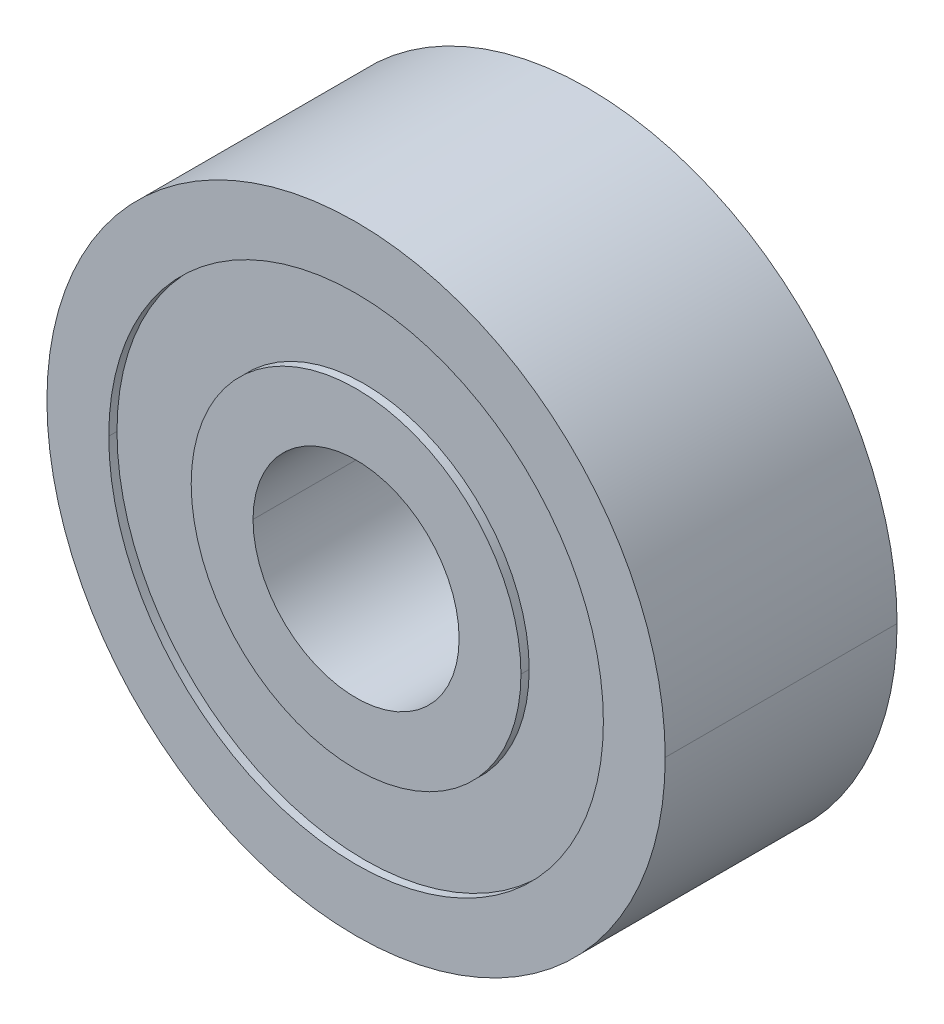
ISO-10303-21;
HEADER;
FILE_DESCRIPTION(('STEP AP214'),'2;1');
FILE_NAME('part.step','',(''),(''),'','','');
FILE_SCHEMA(('AUTOMOTIVE_DESIGN { 1 0 10303 214 1 1 1 1 }'));
ENDSEC;
DATA;
#1=APPLICATION_CONTEXT('core data for automotive mechanical design processes');
#2=APPLICATION_PROTOCOL_DEFINITION('international standard','automotive_design',2000,#1);
#3=PRODUCT_CONTEXT('',#1,'mechanical');
#4=PRODUCT('Part','Part','',(#3));
#5=PRODUCT_RELATED_PRODUCT_CATEGORY('part','',(#4));
#6=PRODUCT_DEFINITION_FORMATION('','',#4);
#7=PRODUCT_DEFINITION_CONTEXT('part definition',#1,'design');
#8=PRODUCT_DEFINITION('design','',#6,#7);
#9=PRODUCT_DEFINITION_SHAPE('','',#8);
#10=(LENGTH_UNIT() NAMED_UNIT(*) SI_UNIT(.MILLI.,.METRE.));
#11=(NAMED_UNIT(*) PLANE_ANGLE_UNIT() SI_UNIT($,.RADIAN.));
#12=(NAMED_UNIT(*) SI_UNIT($,.STERADIAN.) SOLID_ANGLE_UNIT());
#13=UNCERTAINTY_MEASURE_WITH_UNIT(LENGTH_MEASURE(1.E-05),#10,'distance_accuracy_value','');
#14=(GEOMETRIC_REPRESENTATION_CONTEXT(3) GLOBAL_UNCERTAINTY_ASSIGNED_CONTEXT((#13)) GLOBAL_UNIT_ASSIGNED_CONTEXT((#10,
#11,#12)) REPRESENTATION_CONTEXT('',''));
#15=CARTESIAN_POINT('',(0.,0.,0.));
#16=DIRECTION('',(0.,0.,1.));
#17=DIRECTION('',(1.,0.,0.));
#18=AXIS2_PLACEMENT_3D('',#15,#16,#17);
#19=CARTESIAN_POINT('',(0.,0.,-3.571875));
#20=DIRECTION('',(0.,0.,-1.));
#21=DIRECTION('',(-1.,0.,0.));
#22=AXIS2_PLACEMENT_3D('',#19,#20,#21);
#23=CYLINDRICAL_SURFACE('',#22,5.08);
#24=DIRECTION('',(0.,0.,-1.));
#25=VECTOR('',#24,1.);
#26=CARTESIAN_POINT('',(5.08,0.,-3.571875));
#27=LINE('',#26,#25);
#28=CARTESIAN_POINT('',(5.08,0.,-3.317875));
#29=VERTEX_POINT('',#28);
#30=CARTESIAN_POINT('',(5.08,0.,-3.571875));
#31=VERTEX_POINT('',#30);
#32=EDGE_CURVE('E232',#29,#31,#27,.T.);
#33=ORIENTED_EDGE('',*,*,#32,.F.);
#34=CARTESIAN_POINT('',(0.,0.,-3.317875));
#35=DIRECTION('',(0.,0.,-1.));
#36=DIRECTION('',(-1.,0.,0.));
#37=AXIS2_PLACEMENT_3D('',#34,#35,#36);
#38=CIRCLE('',#37,5.08);
#39=CARTESIAN_POINT('',(-5.08,0.,-3.317875));
#40=VERTEX_POINT('',#39);
#41=EDGE_CURVE('E11',#29,#40,#38,.T.);
#42=ORIENTED_EDGE('',*,*,#41,.T.);
#43=DIRECTION('',(0.,0.,-1.));
#44=VECTOR('',#43,1.);
#45=CARTESIAN_POINT('',(-5.08,0.,-3.571875));
#46=LINE('',#45,#44);
#47=CARTESIAN_POINT('',(-5.08,0.,-3.571875));
#48=VERTEX_POINT('',#47);
#49=EDGE_CURVE('E154',#40,#48,#46,.T.);
#50=ORIENTED_EDGE('',*,*,#49,.T.);
#51=CARTESIAN_POINT('',(0.,0.,-3.571875));
#52=DIRECTION('',(0.,0.,-1.));
#53=DIRECTION('',(-1.,0.,0.));
#54=AXIS2_PLACEMENT_3D('',#51,#52,#53);
#55=CIRCLE('',#54,5.08);
#56=EDGE_CURVE('E239',#31,#48,#55,.T.);
#57=ORIENTED_EDGE('',*,*,#56,.F.);
#58=EDGE_LOOP('',(#33,#42,#50,#57));
#59=FACE_BOUND('',#58,.T.);
#60=ADVANCED_FACE('F16',(#59),#23,.T.);
#61=CARTESIAN_POINT('',(7.62,0.,-3.317875));
#62=DIRECTION('',(0.,0.,1.));
#63=DIRECTION('',(1.,0.,0.));
#64=AXIS2_PLACEMENT_3D('',#61,#62,#63);
#65=PLANE('',#64);
#66=CARTESIAN_POINT('',(0.,0.,-3.317875));
#67=DIRECTION('',(0.,0.,-1.));
#68=DIRECTION('',(-1.,0.,0.));
#69=AXIS2_PLACEMENT_3D('',#66,#67,#68);
#70=CIRCLE('',#69,5.08);
#71=EDGE_CURVE('E236',#40,#29,#70,.T.);
#72=ORIENTED_EDGE('',*,*,#71,.F.);
#73=ORIENTED_EDGE('',*,*,#41,.F.);
#74=EDGE_LOOP('',(#72,#73));
#75=FACE_BOUND('',#74,.T.);
#76=CARTESIAN_POINT('',(0.,0.,-3.317875));
#77=DIRECTION('',(0.,0.,-1.));
#78=DIRECTION('',(-1.,0.,0.));
#79=AXIS2_PLACEMENT_3D('',#76,#77,#78);
#80=CIRCLE('',#79,7.62);
#81=CARTESIAN_POINT('',(-7.62,0.,-3.317875));
#82=VERTEX_POINT('',#81);
#83=CARTESIAN_POINT('',(7.62,0.,-3.317875));
#84=VERTEX_POINT('',#83);
#85=EDGE_CURVE('E27',#82,#84,#80,.T.);
#86=ORIENTED_EDGE('',*,*,#85,.T.);
#87=CARTESIAN_POINT('',(0.,0.,-3.317875));
#88=DIRECTION('',(0.,0.,-1.));
#89=DIRECTION('',(-1.,0.,0.));
#90=AXIS2_PLACEMENT_3D('',#87,#88,#89);
#91=CIRCLE('',#90,7.62);
#92=EDGE_CURVE('E146',#84,#82,#91,.T.);
#93=ORIENTED_EDGE('',*,*,#92,.T.);
#94=EDGE_LOOP('',(#86,#93));
#95=FACE_BOUND('',#94,.T.);
#96=ADVANCED_FACE('F152',(#75,#95),#65,.F.);
#97=CARTESIAN_POINT('',(0.,0.,-3.571875));
#98=DIRECTION('',(0.,0.,-1.));
#99=DIRECTION('',(-1.,0.,0.));
#100=AXIS2_PLACEMENT_3D('',#97,#98,#99);
#101=CYLINDRICAL_SURFACE('',#100,7.62);
#102=DIRECTION('',(0.,0.,-1.));
#103=VECTOR('',#102,1.);
#104=CARTESIAN_POINT('',(7.62,0.,-3.571875));
#105=LINE('',#104,#103);
#106=CARTESIAN_POINT('',(7.62,0.,-3.571875));
#107=VERTEX_POINT('',#106);
#108=EDGE_CURVE('E137',#84,#107,#105,.T.);
#109=ORIENTED_EDGE('',*,*,#108,.F.);
#110=ORIENTED_EDGE('',*,*,#85,.F.);
#111=DIRECTION('',(0.,0.,-1.));
#112=VECTOR('',#111,1.);
#113=CARTESIAN_POINT('',(-7.62,0.,-3.571875));
#114=LINE('',#113,#112);
#115=CARTESIAN_POINT('',(-7.62,0.,-3.571875));
#116=VERTEX_POINT('',#115);
#117=EDGE_CURVE('E134',#82,#116,#114,.T.);
#118=ORIENTED_EDGE('',*,*,#117,.T.);
#119=CARTESIAN_POINT('',(0.,0.,-3.571875));
#120=DIRECTION('',(0.,0.,-1.));
#121=DIRECTION('',(-1.,0.,0.));
#122=AXIS2_PLACEMENT_3D('',#119,#120,#121);
#123=CIRCLE('',#122,7.62);
#124=EDGE_CURVE('E142',#116,#107,#123,.T.);
#125=ORIENTED_EDGE('',*,*,#124,.T.);
#126=EDGE_LOOP('',(#109,#110,#118,#125));
#127=FACE_BOUND('',#126,.T.);
#128=ADVANCED_FACE('F133',(#127),#101,.F.);
#129=CARTESIAN_POINT('',(9.525,0.,-3.571875));
#130=DIRECTION('',(0.,0.,1.));
#131=DIRECTION('',(1.,0.,0.));
#132=AXIS2_PLACEMENT_3D('',#129,#130,#131);
#133=PLANE('',#132);
#134=ORIENTED_EDGE('',*,*,#124,.F.);
#135=CARTESIAN_POINT('',(0.,0.,-3.571875));
#136=DIRECTION('',(0.,0.,-1.));
#137=DIRECTION('',(-1.,0.,0.));
#138=AXIS2_PLACEMENT_3D('',#135,#136,#137);
#139=CIRCLE('',#138,7.62);
#140=EDGE_CURVE('E148',#107,#116,#139,.T.);
#141=ORIENTED_EDGE('',*,*,#140,.F.);
#142=EDGE_LOOP('',(#134,#141));
#143=FACE_BOUND('',#142,.T.);
#144=CARTESIAN_POINT('',(0.,0.,-3.571875));
#145=DIRECTION('',(0.,0.,-1.));
#146=DIRECTION('',(-1.,0.,0.));
#147=AXIS2_PLACEMENT_3D('',#144,#145,#146);
#148=CIRCLE('',#147,9.525);
#149=CARTESIAN_POINT('',(-9.525,0.,-3.571875));
#150=VERTEX_POINT('',#149);
#151=CARTESIAN_POINT('',(9.525,0.,-3.571875));
#152=VERTEX_POINT('',#151);
#153=EDGE_CURVE('E173',#150,#152,#148,.T.);
#154=ORIENTED_EDGE('',*,*,#153,.T.);
#155=CARTESIAN_POINT('',(0.,0.,-3.571875));
#156=DIRECTION('',(0.,0.,-1.));
#157=DIRECTION('',(-1.,0.,0.));
#158=AXIS2_PLACEMENT_3D('',#155,#156,#157);
#159=CIRCLE('',#158,9.525);
#160=EDGE_CURVE('E231',#152,#150,#159,.T.);
#161=ORIENTED_EDGE('',*,*,#160,.T.);
#162=EDGE_LOOP('',(#154,#161));
#163=FACE_BOUND('',#162,.T.);
#164=ADVANCED_FACE('F336',(#143,#163),#133,.F.);
#165=CARTESIAN_POINT('',(0.,0.,-3.571875));
#166=DIRECTION('',(0.,0.,-1.));
#167=DIRECTION('',(-1.,0.,0.));
#168=AXIS2_PLACEMENT_3D('',#165,#166,#167);
#169=CYLINDRICAL_SURFACE('',#168,9.525);
#170=DIRECTION('',(0.,0.,-1.));
#171=VECTOR('',#170,1.);
#172=CARTESIAN_POINT('',(9.525,0.,-3.571875));
#173=LINE('',#172,#171);
#174=CARTESIAN_POINT('',(9.525,0.,3.571875));
#175=VERTEX_POINT('',#174);
#176=EDGE_CURVE('E169',#175,#152,#173,.T.);
#177=ORIENTED_EDGE('',*,*,#176,.F.);
#178=CARTESIAN_POINT('',(0.,0.,3.571875));
#179=DIRECTION('',(0.,0.,-1.));
#180=DIRECTION('',(-1.,0.,0.));
#181=AXIS2_PLACEMENT_3D('',#178,#179,#180);
#182=CIRCLE('',#181,9.525);
#183=CARTESIAN_POINT('',(-9.525,0.,3.571875));
#184=VERTEX_POINT('',#183);
#185=EDGE_CURVE('E190',#175,#184,#182,.T.);
#186=ORIENTED_EDGE('',*,*,#185,.T.);
#187=DIRECTION('',(0.,0.,-1.));
#188=VECTOR('',#187,1.);
#189=CARTESIAN_POINT('',(-9.525,0.,-3.571875));
#190=LINE('',#189,#188);
#191=EDGE_CURVE('E210',#184,#150,#190,.T.);
#192=ORIENTED_EDGE('',*,*,#191,.T.);
#193=ORIENTED_EDGE('',*,*,#160,.F.);
#194=EDGE_LOOP('',(#177,#186,#192,#193));
#195=FACE_BOUND('',#194,.T.);
#196=ADVANCED_FACE('F18',(#195),#169,.T.);
#197=CARTESIAN_POINT('',(7.62,0.,3.571875));
#198=DIRECTION('',(0.,0.,-1.));
#199=DIRECTION('',(0.,-1.,0.));
#200=AXIS2_PLACEMENT_3D('',#197,#198,#199);
#201=PLANE('',#200);
#202=CARTESIAN_POINT('',(0.,0.,3.571875));
#203=DIRECTION('',(0.,0.,-1.));
#204=DIRECTION('',(-1.,0.,0.));
#205=AXIS2_PLACEMENT_3D('',#202,#203,#204);
#206=CIRCLE('',#205,7.62);
#207=CARTESIAN_POINT('',(-7.62,0.,3.571875));
#208=VERTEX_POINT('',#207);
#209=CARTESIAN_POINT('',(7.62,0.,3.571875));
#210=VERTEX_POINT('',#209);
#211=EDGE_CURVE('E180',#208,#210,#206,.T.);
#212=ORIENTED_EDGE('',*,*,#211,.T.);
#213=CARTESIAN_POINT('',(0.,0.,3.571875));
#214=DIRECTION('',(0.,0.,-1.));
#215=DIRECTION('',(-1.,0.,0.));
#216=AXIS2_PLACEMENT_3D('',#213,#214,#215);
#217=CIRCLE('',#216,7.62);
#218=EDGE_CURVE('E213',#210,#208,#217,.T.);
#219=ORIENTED_EDGE('',*,*,#218,.T.);
#220=EDGE_LOOP('',(#212,#219));
#221=FACE_BOUND('',#220,.T.);
#222=CARTESIAN_POINT('',(0.,0.,3.571875));
#223=DIRECTION('',(0.,0.,-1.));
#224=DIRECTION('',(-1.,0.,0.));
#225=AXIS2_PLACEMENT_3D('',#222,#223,#224);
#226=CIRCLE('',#225,9.525);
#227=EDGE_CURVE('E150',#184,#175,#226,.T.);
#228=ORIENTED_EDGE('',*,*,#227,.F.);
#229=ORIENTED_EDGE('',*,*,#185,.F.);
#230=EDGE_LOOP('',(#228,#229));
#231=FACE_BOUND('',#230,.T.);
#232=ADVANCED_FACE('F332',(#221,#231),#201,.F.);
#233=CARTESIAN_POINT('',(0.,0.,-3.571875));
#234=DIRECTION('',(0.,0.,-1.));
#235=DIRECTION('',(-1.,0.,0.));
#236=AXIS2_PLACEMENT_3D('',#233,#234,#235);
#237=CYLINDRICAL_SURFACE('',#236,7.62);
#238=DIRECTION('',(0.,0.,-1.));
#239=VECTOR('',#238,1.);
#240=CARTESIAN_POINT('',(7.62,0.,-3.571875));
#241=LINE('',#240,#239);
#242=CARTESIAN_POINT('',(7.62,0.,3.317875));
#243=VERTEX_POINT('',#242);
#244=EDGE_CURVE('E248',#210,#243,#241,.T.);
#245=ORIENTED_EDGE('',*,*,#244,.F.);
#246=ORIENTED_EDGE('',*,*,#211,.F.);
#247=DIRECTION('',(0.,0.,-1.));
#248=VECTOR('',#247,1.);
#249=CARTESIAN_POINT('',(-7.62,0.,-3.571875));
#250=LINE('',#249,#248);
#251=CARTESIAN_POINT('',(-7.62,0.,3.317875));
#252=VERTEX_POINT('',#251);
#253=EDGE_CURVE('E220',#208,#252,#250,.T.);
#254=ORIENTED_EDGE('',*,*,#253,.T.);
#255=CARTESIAN_POINT('',(0.,0.,3.317875));
#256=DIRECTION('',(0.,0.,-1.));
#257=DIRECTION('',(-1.,0.,0.));
#258=AXIS2_PLACEMENT_3D('',#255,#256,#257);
#259=CIRCLE('',#258,7.62);
#260=EDGE_CURVE('E178',#252,#243,#259,.T.);
#261=ORIENTED_EDGE('',*,*,#260,.T.);
#262=EDGE_LOOP('',(#245,#246,#254,#261));
#263=FACE_BOUND('',#262,.T.);
#264=ADVANCED_FACE('F329',(#263),#237,.F.);
#265=CARTESIAN_POINT('',(5.08,0.,3.317875));
#266=DIRECTION('',(0.,0.,-1.));
#267=DIRECTION('',(0.,-1.,0.));
#268=AXIS2_PLACEMENT_3D('',#265,#266,#267);
#269=PLANE('',#268);
#270=CARTESIAN_POINT('',(0.,0.,3.317875));
#271=DIRECTION('',(0.,0.,-1.));
#272=DIRECTION('',(-1.,0.,0.));
#273=AXIS2_PLACEMENT_3D('',#270,#271,#272);
#274=CIRCLE('',#273,5.08);
#275=CARTESIAN_POINT('',(-5.08,0.,3.317875));
#276=VERTEX_POINT('',#275);
#277=CARTESIAN_POINT('',(5.08,0.,3.317875));
#278=VERTEX_POINT('',#277);
#279=EDGE_CURVE('E250',#276,#278,#274,.T.);
#280=ORIENTED_EDGE('',*,*,#279,.T.);
#281=CARTESIAN_POINT('',(0.,0.,3.317875));
#282=DIRECTION('',(0.,0.,-1.));
#283=DIRECTION('',(-1.,0.,0.));
#284=AXIS2_PLACEMENT_3D('',#281,#282,#283);
#285=CIRCLE('',#284,5.08);
#286=EDGE_CURVE('E181',#278,#276,#285,.T.);
#287=ORIENTED_EDGE('',*,*,#286,.T.);
#288=EDGE_LOOP('',(#280,#287));
#289=FACE_BOUND('',#288,.T.);
#290=ORIENTED_EDGE('',*,*,#260,.F.);
#291=CARTESIAN_POINT('',(0.,0.,3.317875));
#292=DIRECTION('',(0.,0.,-1.));
#293=DIRECTION('',(-1.,0.,0.));
#294=AXIS2_PLACEMENT_3D('',#291,#292,#293);
#295=CIRCLE('',#294,7.62);
#296=EDGE_CURVE('E226',#243,#252,#295,.T.);
#297=ORIENTED_EDGE('',*,*,#296,.F.);
#298=EDGE_LOOP('',(#290,#297));
#299=FACE_BOUND('',#298,.T.);
#300=ADVANCED_FACE('F318',(#289,#299),#269,.F.);
#301=CARTESIAN_POINT('',(0.,0.,-3.571875));
#302=DIRECTION('',(0.,0.,-1.));
#303=DIRECTION('',(-1.,0.,0.));
#304=AXIS2_PLACEMENT_3D('',#301,#302,#303);
#305=CYLINDRICAL_SURFACE('',#304,5.08);
#306=DIRECTION('',(0.,0.,-1.));
#307=VECTOR('',#306,1.);
#308=CARTESIAN_POINT('',(5.08,0.,-3.571875));
#309=LINE('',#308,#307);
#310=CARTESIAN_POINT('',(5.08,0.,3.571875));
#311=VERTEX_POINT('',#310);
#312=EDGE_CURVE('E219',#311,#278,#309,.T.);
#313=ORIENTED_EDGE('',*,*,#312,.F.);
#314=CARTESIAN_POINT('',(0.,0.,3.571875));
#315=DIRECTION('',(0.,0.,-1.));
#316=DIRECTION('',(-1.,0.,0.));
#317=AXIS2_PLACEMENT_3D('',#314,#315,#316);
#318=CIRCLE('',#317,5.08);
#319=CARTESIAN_POINT('',(-5.08,0.,3.571875));
#320=VERTEX_POINT('',#319);
#321=EDGE_CURVE('E192',#311,#320,#318,.T.);
#322=ORIENTED_EDGE('',*,*,#321,.T.);
#323=DIRECTION('',(0.,0.,-1.));
#324=VECTOR('',#323,1.);
#325=CARTESIAN_POINT('',(-5.08,0.,-3.571875));
#326=LINE('',#325,#324);
#327=EDGE_CURVE('E166',#320,#276,#326,.T.);
#328=ORIENTED_EDGE('',*,*,#327,.T.);
#329=ORIENTED_EDGE('',*,*,#286,.F.);
#330=EDGE_LOOP('',(#313,#322,#328,#329));
#331=FACE_BOUND('',#330,.T.);
#332=ADVANCED_FACE('F327',(#331),#305,.T.);
#333=CARTESIAN_POINT('',(3.175,0.,3.571875));
#334=DIRECTION('',(0.,0.,-1.));
#335=DIRECTION('',(0.,-1.,0.));
#336=AXIS2_PLACEMENT_3D('',#333,#334,#335);
#337=PLANE('',#336);
#338=CARTESIAN_POINT('',(0.,0.,3.571875));
#339=DIRECTION('',(0.,0.,-1.));
#340=DIRECTION('',(-1.,0.,0.));
#341=AXIS2_PLACEMENT_3D('',#338,#339,#340);
#342=CIRCLE('',#341,3.175);
#343=CARTESIAN_POINT('',(-3.175,0.,3.571875));
#344=VERTEX_POINT('',#343);
#345=CARTESIAN_POINT('',(3.175,0.,3.571875));
#346=VERTEX_POINT('',#345);
#347=EDGE_CURVE('E200',#344,#346,#342,.T.);
#348=ORIENTED_EDGE('',*,*,#347,.T.);
#349=CARTESIAN_POINT('',(0.,0.,3.571875));
#350=DIRECTION('',(0.,0.,-1.));
#351=DIRECTION('',(-1.,0.,0.));
#352=AXIS2_PLACEMENT_3D('',#349,#350,#351);
#353=CIRCLE('',#352,3.175);
#354=EDGE_CURVE('E20',#346,#344,#353,.T.);
#355=ORIENTED_EDGE('',*,*,#354,.T.);
#356=EDGE_LOOP('',(#348,#355));
#357=FACE_BOUND('',#356,.T.);
#358=CARTESIAN_POINT('',(0.,0.,3.571875));
#359=DIRECTION('',(0.,0.,-1.));
#360=DIRECTION('',(-1.,0.,0.));
#361=AXIS2_PLACEMENT_3D('',#358,#359,#360);
#362=CIRCLE('',#361,5.08);
#363=EDGE_CURVE('E215',#320,#311,#362,.T.);
#364=ORIENTED_EDGE('',*,*,#363,.F.);
#365=ORIENTED_EDGE('',*,*,#321,.F.);
#366=EDGE_LOOP('',(#364,#365));
#367=FACE_BOUND('',#366,.T.);
#368=ADVANCED_FACE('F307',(#357,#367),#337,.F.);
#369=CARTESIAN_POINT('',(0.,0.,-3.571875));
#370=DIRECTION('',(0.,0.,-1.));
#371=DIRECTION('',(-1.,0.,0.));
#372=AXIS2_PLACEMENT_3D('',#369,#370,#371);
#373=CYLINDRICAL_SURFACE('',#372,3.175);
#374=DIRECTION('',(0.,0.,-1.));
#375=VECTOR('',#374,1.);
#376=CARTESIAN_POINT('',(3.175,0.,-3.571875));
#377=LINE('',#376,#375);
#378=CARTESIAN_POINT('',(3.175,0.,-3.571875));
#379=VERTEX_POINT('',#378);
#380=EDGE_CURVE('E174',#346,#379,#377,.T.);
#381=ORIENTED_EDGE('',*,*,#380,.F.);
#382=ORIENTED_EDGE('',*,*,#347,.F.);
#383=DIRECTION('',(0.,0.,-1.));
#384=VECTOR('',#383,1.);
#385=CARTESIAN_POINT('',(-3.175,0.,-3.571875));
#386=LINE('',#385,#384);
#387=CARTESIAN_POINT('',(-3.175,0.,-3.571875));
#388=VERTEX_POINT('',#387);
#389=EDGE_CURVE('E209',#344,#388,#386,.T.);
#390=ORIENTED_EDGE('',*,*,#389,.T.);
#391=CARTESIAN_POINT('',(0.,0.,-3.571875));
#392=DIRECTION('',(0.,0.,-1.));
#393=DIRECTION('',(-1.,0.,0.));
#394=AXIS2_PLACEMENT_3D('',#391,#392,#393);
#395=CIRCLE('',#394,3.175);
#396=EDGE_CURVE('E41',#388,#379,#395,.T.);
#397=ORIENTED_EDGE('',*,*,#396,.T.);
#398=EDGE_LOOP('',(#381,#382,#390,#397));
#399=FACE_BOUND('',#398,.T.);
#400=ADVANCED_FACE('F297',(#399),#373,.F.);
#401=CARTESIAN_POINT('',(5.08,0.,-3.571875));
#402=DIRECTION('',(0.,0.,1.));
#403=DIRECTION('',(1.,0.,0.));
#404=AXIS2_PLACEMENT_3D('',#401,#402,#403);
#405=PLANE('',#404);
#406=ORIENTED_EDGE('',*,*,#396,.F.);
#407=CARTESIAN_POINT('',(0.,0.,-3.571875));
#408=DIRECTION('',(0.,0.,-1.));
#409=DIRECTION('',(-1.,0.,0.));
#410=AXIS2_PLACEMENT_3D('',#407,#408,#409);
#411=CIRCLE('',#410,3.175);
#412=EDGE_CURVE('E177',#379,#388,#411,.T.);
#413=ORIENTED_EDGE('',*,*,#412,.F.);
#414=EDGE_LOOP('',(#406,#413));
#415=FACE_BOUND('',#414,.T.);
#416=CARTESIAN_POINT('',(0.,0.,-3.571875));
#417=DIRECTION('',(0.,0.,-1.));
#418=DIRECTION('',(-1.,0.,0.));
#419=AXIS2_PLACEMENT_3D('',#416,#417,#418);
#420=CIRCLE('',#419,5.08);
#421=EDGE_CURVE('E163',#48,#31,#420,.T.);
#422=ORIENTED_EDGE('',*,*,#421,.T.);
#423=ORIENTED_EDGE('',*,*,#56,.T.);
#424=EDGE_LOOP('',(#422,#423));
#425=FACE_BOUND('',#424,.T.);
#426=ADVANCED_FACE('F294',(#415,#425),#405,.F.);
#427=CARTESIAN_POINT('',(0.,0.,-3.571875));
#428=DIRECTION('',(0.,0.,-1.));
#429=DIRECTION('',(-1.,0.,0.));
#430=AXIS2_PLACEMENT_3D('',#427,#428,#429);
#431=CYLINDRICAL_SURFACE('',#430,3.175);
#432=ORIENTED_EDGE('',*,*,#354,.F.);
#433=ORIENTED_EDGE('',*,*,#380,.T.);
#434=ORIENTED_EDGE('',*,*,#412,.T.);
#435=ORIENTED_EDGE('',*,*,#389,.F.);
#436=EDGE_LOOP('',(#432,#433,#434,#435));
#437=FACE_BOUND('',#436,.T.);
#438=ADVANCED_FACE('F296',(#437),#431,.F.);
#439=CARTESIAN_POINT('',(0.,0.,-3.571875));
#440=DIRECTION('',(0.,0.,-1.));
#441=DIRECTION('',(-1.,0.,0.));
#442=AXIS2_PLACEMENT_3D('',#439,#440,#441);
#443=CYLINDRICAL_SURFACE('',#442,5.08);
#444=ORIENTED_EDGE('',*,*,#363,.T.);
#445=ORIENTED_EDGE('',*,*,#312,.T.);
#446=ORIENTED_EDGE('',*,*,#279,.F.);
#447=ORIENTED_EDGE('',*,*,#327,.F.);
#448=EDGE_LOOP('',(#444,#445,#446,#447));
#449=FACE_BOUND('',#448,.T.);
#450=ADVANCED_FACE('F304',(#449),#443,.T.);
#451=CARTESIAN_POINT('',(0.,0.,-3.571875));
#452=DIRECTION('',(0.,0.,-1.));
#453=DIRECTION('',(-1.,0.,0.));
#454=AXIS2_PLACEMENT_3D('',#451,#452,#453);
#455=CYLINDRICAL_SURFACE('',#454,7.62);
#456=ORIENTED_EDGE('',*,*,#218,.F.);
#457=ORIENTED_EDGE('',*,*,#244,.T.);
#458=ORIENTED_EDGE('',*,*,#296,.T.);
#459=ORIENTED_EDGE('',*,*,#253,.F.);
#460=EDGE_LOOP('',(#456,#457,#458,#459));
#461=FACE_BOUND('',#460,.T.);
#462=ADVANCED_FACE('F322',(#461),#455,.F.);
#463=CARTESIAN_POINT('',(0.,0.,-3.571875));
#464=DIRECTION('',(0.,0.,-1.));
#465=DIRECTION('',(-1.,0.,0.));
#466=AXIS2_PLACEMENT_3D('',#463,#464,#465);
#467=CYLINDRICAL_SURFACE('',#466,9.525);
#468=ORIENTED_EDGE('',*,*,#227,.T.);
#469=ORIENTED_EDGE('',*,*,#176,.T.);
#470=ORIENTED_EDGE('',*,*,#153,.F.);
#471=ORIENTED_EDGE('',*,*,#191,.F.);
#472=EDGE_LOOP('',(#468,#469,#470,#471));
#473=FACE_BOUND('',#472,.T.);
#474=ADVANCED_FACE('F320',(#473),#467,.T.);
#475=CARTESIAN_POINT('',(0.,0.,-3.571875));
#476=DIRECTION('',(0.,0.,-1.));
#477=DIRECTION('',(-1.,0.,0.));
#478=AXIS2_PLACEMENT_3D('',#475,#476,#477);
#479=CYLINDRICAL_SURFACE('',#478,7.62);
#480=ORIENTED_EDGE('',*,*,#92,.F.);
#481=ORIENTED_EDGE('',*,*,#108,.T.);
#482=ORIENTED_EDGE('',*,*,#140,.T.);
#483=ORIENTED_EDGE('',*,*,#117,.F.);
#484=EDGE_LOOP('',(#480,#481,#482,#483));
#485=FACE_BOUND('',#484,.T.);
#486=ADVANCED_FACE('F145',(#485),#479,.F.);
#487=CARTESIAN_POINT('',(0.,0.,-3.571875));
#488=DIRECTION('',(0.,0.,-1.));
#489=DIRECTION('',(-1.,0.,0.));
#490=AXIS2_PLACEMENT_3D('',#487,#488,#489);
#491=CYLINDRICAL_SURFACE('',#490,5.08);
#492=ORIENTED_EDGE('',*,*,#71,.T.);
#493=ORIENTED_EDGE('',*,*,#32,.T.);
#494=ORIENTED_EDGE('',*,*,#421,.F.);
#495=ORIENTED_EDGE('',*,*,#49,.F.);
#496=EDGE_LOOP('',(#492,#493,#494,#495));
#497=FACE_BOUND('',#496,.T.);
#498=ADVANCED_FACE('F289',(#497),#491,.T.);
#499=CLOSED_SHELL('',(#60,#96,#128,#164,#196,#232,#264,#300,#332,#368,#400,#426,#438,#450,#462,
#474,#486,#498));
#500=MANIFOLD_SOLID_BREP('B1',#499);
#501=ADVANCED_BREP_SHAPE_REPRESENTATION('',(#18,#500),#14);
#502=SHAPE_DEFINITION_REPRESENTATION(#9,#501);
ENDSEC;
END-ISO-10303-21;
